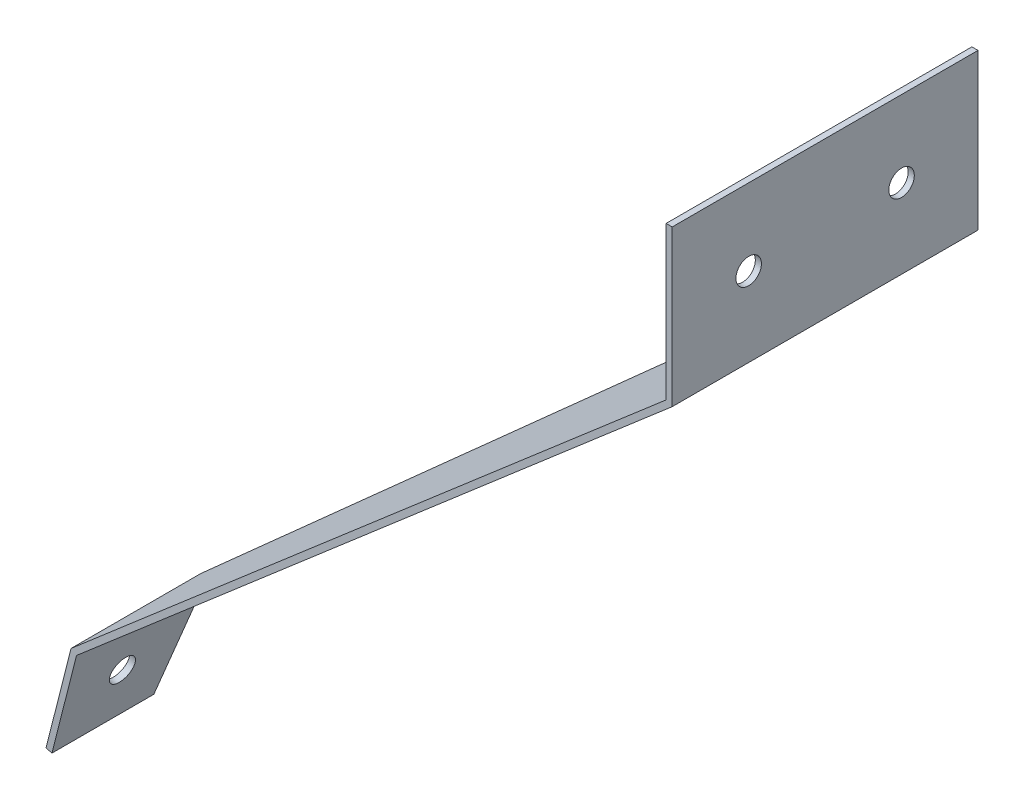
ISO-10303-21;
HEADER;
FILE_DESCRIPTION(('STEP AP214'),'2;1');
FILE_NAME('part.step','',(''),(''),'','','');
FILE_SCHEMA(('AUTOMOTIVE_DESIGN { 1 0 10303 214 1 1 1 1 }'));
ENDSEC;
DATA;
#1=APPLICATION_CONTEXT('core data for automotive mechanical design processes');
#2=APPLICATION_PROTOCOL_DEFINITION('international standard','automotive_design',2000,#1);
#3=PRODUCT_CONTEXT('',#1,'mechanical');
#4=PRODUCT('Part','Part','',(#3));
#5=PRODUCT_RELATED_PRODUCT_CATEGORY('part','',(#4));
#6=PRODUCT_DEFINITION_FORMATION('','',#4);
#7=PRODUCT_DEFINITION_CONTEXT('part definition',#1,'design');
#8=PRODUCT_DEFINITION('design','',#6,#7);
#9=PRODUCT_DEFINITION_SHAPE('','',#8);
#10=(LENGTH_UNIT() NAMED_UNIT(*) SI_UNIT(.MILLI.,.METRE.));
#11=(NAMED_UNIT(*) PLANE_ANGLE_UNIT() SI_UNIT($,.RADIAN.));
#12=(NAMED_UNIT(*) SI_UNIT($,.STERADIAN.) SOLID_ANGLE_UNIT());
#13=UNCERTAINTY_MEASURE_WITH_UNIT(LENGTH_MEASURE(1.E-05),#10,'distance_accuracy_value','');
#14=(GEOMETRIC_REPRESENTATION_CONTEXT(3) GLOBAL_UNCERTAINTY_ASSIGNED_CONTEXT((#13)) GLOBAL_UNIT_ASSIGNED_CONTEXT((#10,
#11,#12)) REPRESENTATION_CONTEXT('',''));
#15=CARTESIAN_POINT('',(0.,0.,0.));
#16=DIRECTION('',(0.,0.,1.));
#17=DIRECTION('',(1.,0.,0.));
#18=AXIS2_PLACEMENT_3D('',#15,#16,#17);
#19=CARTESIAN_POINT('',(0.,0.,76.2));
#20=DIRECTION('',(-1.,0.,0.));
#21=DIRECTION('',(0.,0.,1.));
#22=AXIS2_PLACEMENT_3D('',#19,#20,#21);
#23=PLANE('',#22);
#24=CARTESIAN_POINT('',(0.,19.05,19.05));
#25=DIRECTION('',(-1.,0.,0.));
#26=DIRECTION('',(0.,0.,1.));
#27=AXIS2_PLACEMENT_3D('',#24,#25,#26);
#28=CIRCLE('',#27,3.175);
#29=CARTESIAN_POINT('',(0.,19.05,22.225));
#30=VERTEX_POINT('',#29);
#31=EDGE_CURVE('E231',#30,#30,#28,.T.);
#32=ORIENTED_EDGE('',*,*,#31,.F.);
#33=EDGE_LOOP('',(#32));
#34=FACE_BOUND('',#33,.T.);
#35=CARTESIAN_POINT('',(0.,19.05,57.15));
#36=DIRECTION('',(-1.,0.,0.));
#37=DIRECTION('',(0.,0.,1.));
#38=AXIS2_PLACEMENT_3D('',#35,#36,#37);
#39=CIRCLE('',#38,3.175);
#40=CARTESIAN_POINT('',(0.,19.05,60.325));
#41=VERTEX_POINT('',#40);
#42=EDGE_CURVE('E223',#41,#41,#39,.T.);
#43=ORIENTED_EDGE('',*,*,#42,.F.);
#44=EDGE_LOOP('',(#43));
#45=FACE_BOUND('',#44,.T.);
#46=DIRECTION('',(0.,1.,0.));
#47=VECTOR('',#46,1.);
#48=CARTESIAN_POINT('',(0.,0.,0.));
#49=LINE('',#48,#47);
#50=CARTESIAN_POINT('',(0.,0.,0.));
#51=VERTEX_POINT('',#50);
#52=CARTESIAN_POINT('',(0.,38.1,0.));
#53=VERTEX_POINT('',#52);
#54=EDGE_CURVE('E207',#51,#53,#49,.T.);
#55=ORIENTED_EDGE('',*,*,#54,.F.);
#56=DIRECTION('',(0.,0.,-1.));
#57=VECTOR('',#56,1.);
#58=CARTESIAN_POINT('',(0.,0.,76.2));
#59=LINE('',#58,#57);
#60=CARTESIAN_POINT('',(0.,0.,76.2));
#61=VERTEX_POINT('',#60);
#62=EDGE_CURVE('E56',#61,#51,#59,.T.);
#63=ORIENTED_EDGE('',*,*,#62,.F.);
#64=DIRECTION('',(0.,1.,0.));
#65=VECTOR('',#64,1.);
#66=CARTESIAN_POINT('',(0.,0.,76.2));
#67=LINE('',#66,#65);
#68=CARTESIAN_POINT('',(0.,38.1,76.2));
#69=VERTEX_POINT('',#68);
#70=EDGE_CURVE('E177',#61,#69,#67,.T.);
#71=ORIENTED_EDGE('',*,*,#70,.T.);
#72=DIRECTION('',(0.,0.,-1.));
#73=VECTOR('',#72,1.);
#74=CARTESIAN_POINT('',(0.,38.1,76.2));
#75=LINE('',#74,#73);
#76=EDGE_CURVE('E172',#69,#53,#75,.T.);
#77=ORIENTED_EDGE('',*,*,#76,.T.);
#78=EDGE_LOOP('',(#55,#63,#71,#77));
#79=FACE_BOUND('',#78,.T.);
#80=ADVANCED_FACE('F46',(#34,#45,#79),#23,.T.);
#81=CARTESIAN_POINT('',(0.,0.,76.2));
#82=DIRECTION('',(0.652759752462726,-0.757564984384047,0.));
#83=DIRECTION('',(0.757564984384047,0.652759752462726,0.));
#84=AXIS2_PLACEMENT_3D('',#81,#82,#83);
#85=PLANE('',#84);
#86=ORIENTED_EDGE('',*,*,#62,.T.);
#87=DIRECTION('',(-0.739242312652907,-0.636971928434139,0.218603672362739));
#88=VECTOR('',#87,1.);
#89=CARTESIAN_POINT('',(-12.3140026245629,-10.6104234893731,3.64141249647024));
#90=LINE('',#89,#88);
#91=CARTESIAN_POINT('',(-148.297771302394,-127.781534893448,43.853600984464));
#92=VERTEX_POINT('',#91);
#93=EDGE_CURVE('E87',#51,#92,#90,.T.);
#94=ORIENTED_EDGE('',*,*,#93,.T.);
#95=DIRECTION('',(0.,0.,-1.));
#96=VECTOR('',#95,1.);
#97=CARTESIAN_POINT('',(-148.297771302394,-127.781534893448,76.2));
#98=LINE('',#97,#96);
#99=CARTESIAN_POINT('',(-148.297771302394,-127.781534893448,76.2));
#100=VERTEX_POINT('',#99);
#101=EDGE_CURVE('E133',#100,#92,#98,.T.);
#102=ORIENTED_EDGE('',*,*,#101,.F.);
#103=DIRECTION('',(-0.757564984384047,-0.652759752462726,0.));
#104=VECTOR('',#103,1.);
#105=CARTESIAN_POINT('',(0.,0.,76.2));
#106=LINE('',#105,#104);
#107=EDGE_CURVE('E118',#61,#100,#106,.T.);
#108=ORIENTED_EDGE('',*,*,#107,.F.);
#109=EDGE_LOOP('',(#86,#94,#102,#108));
#110=FACE_BOUND('',#109,.T.);
#111=ADVANCED_FACE('F251',(#110),#85,.F.);
#112=CARTESIAN_POINT('',(-148.297771302394,-127.781534893448,76.2));
#113=DIRECTION('',(0.969230909706754,-0.246153293028993,0.));
#114=DIRECTION('',(0.246153293028993,0.969230909706755,0.));
#115=AXIS2_PLACEMENT_3D('',#112,#113,#114);
#116=PLANE('',#115);
#117=CARTESIAN_POINT('',(-151.423918123863,-140.090767446724,61.763400246116));
#118=DIRECTION('',(-0.969230909706754,0.246153293028993,0.));
#119=DIRECTION('',(-0.246153293028993,-0.969230909706754,0.));
#120=AXIS2_PLACEMENT_3D('',#117,#118,#119);
#121=CIRCLE('',#120,3.17499999999999);
#122=CARTESIAN_POINT('',(-152.20545482923,-143.168075585043,61.763400246116));
#123=VERTEX_POINT('',#122);
#124=EDGE_CURVE('E218',#123,#123,#121,.T.);
#125=ORIENTED_EDGE('',*,*,#124,.F.);
#126=EDGE_LOOP('',(#125));
#127=FACE_BOUND('',#126,.T.);
#128=ORIENTED_EDGE('',*,*,#101,.T.);
#129=DIRECTION('',(0.237434348415611,0.934899983171816,-0.263793388199537));
#130=VECTOR('',#129,1.);
#131=CARTESIAN_POINT('',(-154.550064945331,-152.4,50.8));
#132=LINE('',#131,#130);
#133=CARTESIAN_POINT('',(-154.550064945331,-152.4,50.8));
#134=VERTEX_POINT('',#133);
#135=EDGE_CURVE('E129',#134,#92,#132,.T.);
#136=ORIENTED_EDGE('',*,*,#135,.F.);
#137=DIRECTION('',(0.,0.,-1.));
#138=VECTOR('',#137,1.);
#139=CARTESIAN_POINT('',(-154.550064945331,-152.4,76.2));
#140=LINE('',#139,#138);
#141=CARTESIAN_POINT('',(-154.550064945331,-152.4,76.2));
#142=VERTEX_POINT('',#141);
#143=EDGE_CURVE('E126',#142,#134,#140,.T.);
#144=ORIENTED_EDGE('',*,*,#143,.F.);
#145=DIRECTION('',(-0.246153293028993,-0.969230909706754,0.));
#146=VECTOR('',#145,1.);
#147=CARTESIAN_POINT('',(-148.297771302394,-127.781534893448,76.2));
#148=LINE('',#147,#146);
#149=EDGE_CURVE('E111',#100,#142,#148,.T.);
#150=ORIENTED_EDGE('',*,*,#149,.F.);
#151=EDGE_LOOP('',(#128,#136,#144,#150));
#152=FACE_BOUND('',#151,.T.);
#153=ADVANCED_FACE('F127',(#127,#152),#116,.F.);
#154=CARTESIAN_POINT('',(-154.550064945331,-152.4,76.2));
#155=DIRECTION('',(0.246153293028993,0.969230909706754,0.));
#156=DIRECTION('',(-0.969230909706754,0.246153293028993,0.));
#157=AXIS2_PLACEMENT_3D('',#154,#155,#156);
#158=PLANE('',#157);
#159=ORIENTED_EDGE('',*,*,#143,.T.);
#160=DIRECTION('',(-0.969230909706754,0.246153293028993,0.));
#161=VECTOR('',#160,1.);
#162=CARTESIAN_POINT('',(-7.84325281382625,-189.65878379888,50.8));
#163=LINE('',#162,#161);
#164=CARTESIAN_POINT('',(-153.072957038938,-152.775137618576,50.8));
#165=VERTEX_POINT('',#164);
#166=EDGE_CURVE('E213',#165,#134,#163,.T.);
#167=ORIENTED_EDGE('',*,*,#166,.F.);
#168=DIRECTION('',(0.,0.,-1.));
#169=VECTOR('',#168,1.);
#170=CARTESIAN_POINT('',(-153.072957038938,-152.775137618576,76.2));
#171=LINE('',#170,#169);
#172=CARTESIAN_POINT('',(-153.072957038938,-152.775137618576,76.2));
#173=VERTEX_POINT('',#172);
#174=EDGE_CURVE('E134',#173,#165,#171,.T.);
#175=ORIENTED_EDGE('',*,*,#174,.F.);
#176=DIRECTION('',(0.969230909706755,-0.246153293028993,0.));
#177=VECTOR('',#176,1.);
#178=CARTESIAN_POINT('',(-154.550064945331,-152.4,76.2));
#179=LINE('',#178,#177);
#180=EDGE_CURVE('E116',#142,#173,#179,.T.);
#181=ORIENTED_EDGE('',*,*,#180,.F.);
#182=EDGE_LOOP('',(#159,#167,#175,#181));
#183=FACE_BOUND('',#182,.T.);
#184=ADVANCED_FACE('F135',(#183),#158,.F.);
#185=CARTESIAN_POINT('',(-146.938943832801,-128.622402845954,76.2));
#186=DIRECTION('',(0.969230909706754,-0.246153293028993,0.));
#187=DIRECTION('',(0.246153293028993,0.969230909706755,0.));
#188=AXIS2_PLACEMENT_3D('',#185,#186,#187);
#189=PLANE('',#188);
#190=CARTESIAN_POINT('',(-149.946810217469,-140.4659050653,61.763400246116));
#191=DIRECTION('',(0.969230909706754,-0.246153293028993,0.));
#192=DIRECTION('',(0.246153293028993,0.969230909706755,0.));
#193=AXIS2_PLACEMENT_3D('',#190,#191,#192);
#194=CIRCLE('',#193,3.17499999999999);
#195=CARTESIAN_POINT('',(-149.165273512102,-137.388596926982,61.763400246116));
#196=VERTEX_POINT('',#195);
#197=EDGE_CURVE('E49',#196,#196,#194,.T.);
#198=ORIENTED_EDGE('',*,*,#197,.F.);
#199=EDGE_LOOP('',(#198));
#200=FACE_BOUND('',#199,.T.);
#201=DIRECTION('',(-0.23743434841561,-0.934899983171817,0.263793388199537));
#202=VECTOR('',#201,1.);
#203=CARTESIAN_POINT('',(-148.95668483883,-136.56727706137,46.2267552371265));
#204=LINE('',#203,#202);
#205=CARTESIAN_POINT('',(-146.938943832801,-128.622402845954,43.9850124562641));
#206=VERTEX_POINT('',#205);
#207=EDGE_CURVE('E199',#206,#165,#204,.T.);
#208=ORIENTED_EDGE('',*,*,#207,.F.);
#209=DIRECTION('',(0.,0.,-1.));
#210=VECTOR('',#209,1.);
#211=CARTESIAN_POINT('',(-146.938943832801,-128.622402845954,76.2));
#212=LINE('',#211,#210);
#213=CARTESIAN_POINT('',(-146.938943832801,-128.622402845954,76.2));
#214=VERTEX_POINT('',#213);
#215=EDGE_CURVE('E161',#214,#206,#212,.T.);
#216=ORIENTED_EDGE('',*,*,#215,.F.);
#217=DIRECTION('',(-0.246153293028993,-0.969230909706754,0.));
#218=VECTOR('',#217,1.);
#219=CARTESIAN_POINT('',(-146.938943832801,-128.622402845954,76.2));
#220=LINE('',#219,#218);
#221=EDGE_CURVE('E139',#214,#173,#220,.T.);
#222=ORIENTED_EDGE('',*,*,#221,.T.);
#223=ORIENTED_EDGE('',*,*,#174,.T.);
#224=EDGE_LOOP('',(#208,#216,#222,#223));
#225=FACE_BOUND('',#224,.T.);
#226=ADVANCED_FACE('F196',(#200,#225),#189,.T.);
#227=CARTESIAN_POINT('',(1.524,-0.698546194920925,76.2));
#228=DIRECTION('',(0.652759752462726,-0.757564984384047,0.));
#229=DIRECTION('',(0.757564984384047,0.652759752462726,0.));
#230=AXIS2_PLACEMENT_3D('',#227,#228,#229);
#231=PLANE('',#230);
#232=DIRECTION('',(-0.739242312652907,-0.636971928434139,0.218603672362739));
#233=VECTOR('',#232,1.);
#234=CARTESIAN_POINT('',(-10.7766595813563,-11.2974725827117,3.72003456579985));
#235=LINE('',#234,#233);
#236=CARTESIAN_POINT('',(1.524,-0.698546194920924,0.0825677826573525));
#237=VERTEX_POINT('',#236);
#238=EDGE_CURVE('E204',#237,#206,#235,.T.);
#239=ORIENTED_EDGE('',*,*,#238,.F.);
#240=DIRECTION('',(0.,0.,-1.));
#241=VECTOR('',#240,1.);
#242=CARTESIAN_POINT('',(1.524,-0.698546194920925,76.2));
#243=LINE('',#242,#241);
#244=CARTESIAN_POINT('',(1.524,-0.698546194920925,76.2));
#245=VERTEX_POINT('',#244);
#246=EDGE_CURVE('E165',#245,#237,#243,.T.);
#247=ORIENTED_EDGE('',*,*,#246,.F.);
#248=DIRECTION('',(-0.757564984384047,-0.652759752462726,0.));
#249=VECTOR('',#248,1.);
#250=CARTESIAN_POINT('',(1.524,-0.698546194920925,76.2));
#251=LINE('',#250,#249);
#252=EDGE_CURVE('E142',#245,#214,#251,.T.);
#253=ORIENTED_EDGE('',*,*,#252,.T.);
#254=ORIENTED_EDGE('',*,*,#215,.T.);
#255=EDGE_LOOP('',(#239,#247,#253,#254));
#256=FACE_BOUND('',#255,.T.);
#257=ADVANCED_FACE('F192',(#256),#231,.T.);
#258=CARTESIAN_POINT('',(1.524,-0.698546194920925,76.2));
#259=DIRECTION('',(-1.,0.,0.));
#260=DIRECTION('',(0.,0.,1.));
#261=AXIS2_PLACEMENT_3D('',#258,#259,#260);
#262=PLANE('',#261);
#263=CARTESIAN_POINT('',(1.524,19.05,19.05));
#264=DIRECTION('',(-1.,0.,0.));
#265=DIRECTION('',(0.,0.,1.));
#266=AXIS2_PLACEMENT_3D('',#263,#264,#265);
#267=CIRCLE('',#266,3.175);
#268=CARTESIAN_POINT('',(1.524,19.05,22.225));
#269=VERTEX_POINT('',#268);
#270=EDGE_CURVE('E222',#269,#269,#267,.T.);
#271=ORIENTED_EDGE('',*,*,#270,.T.);
#272=EDGE_LOOP('',(#271));
#273=FACE_BOUND('',#272,.T.);
#274=CARTESIAN_POINT('',(1.524,19.05,57.15));
#275=DIRECTION('',(-1.,0.,0.));
#276=DIRECTION('',(0.,0.,1.));
#277=AXIS2_PLACEMENT_3D('',#274,#275,#276);
#278=CIRCLE('',#277,3.175);
#279=CARTESIAN_POINT('',(1.524,19.05,60.325));
#280=VERTEX_POINT('',#279);
#281=EDGE_CURVE('E227',#280,#280,#278,.T.);
#282=ORIENTED_EDGE('',*,*,#281,.T.);
#283=EDGE_LOOP('',(#282));
#284=FACE_BOUND('',#283,.T.);
#285=ORIENTED_EDGE('',*,*,#246,.T.);
#286=DIRECTION('',(0.,0.966619174412419,-0.256217430434102));
#287=VECTOR('',#286,1.);
#288=CARTESIAN_POINT('',(1.524,-19.5501457693747,5.07947714510121));
#289=LINE('',#288,#287);
#290=CARTESIAN_POINT('',(1.52399999999998,-0.387046693227859,0.));
#291=VERTEX_POINT('',#290);
#292=EDGE_CURVE('E208',#237,#291,#289,.T.);
#293=ORIENTED_EDGE('',*,*,#292,.T.);
#294=DIRECTION('',(0.,1.,0.));
#295=VECTOR('',#294,1.);
#296=CARTESIAN_POINT('',(1.524,-0.698546194920925,0.));
#297=LINE('',#296,#295);
#298=CARTESIAN_POINT('',(1.524,38.1,0.));
#299=VERTEX_POINT('',#298);
#300=EDGE_CURVE('E79',#291,#299,#297,.T.);
#301=ORIENTED_EDGE('',*,*,#300,.T.);
#302=DIRECTION('',(0.,0.,-1.));
#303=VECTOR('',#302,1.);
#304=CARTESIAN_POINT('',(1.524,38.1,76.2));
#305=LINE('',#304,#303);
#306=CARTESIAN_POINT('',(1.524,38.1,76.2));
#307=VERTEX_POINT('',#306);
#308=EDGE_CURVE('E168',#307,#299,#305,.T.);
#309=ORIENTED_EDGE('',*,*,#308,.F.);
#310=DIRECTION('',(0.,1.,0.));
#311=VECTOR('',#310,1.);
#312=CARTESIAN_POINT('',(1.524,-0.698546194920925,76.2));
#313=LINE('',#312,#311);
#314=EDGE_CURVE('E185',#245,#307,#313,.T.);
#315=ORIENTED_EDGE('',*,*,#314,.F.);
#316=EDGE_LOOP('',(#285,#293,#301,#309,#315));
#317=FACE_BOUND('',#316,.T.);
#318=ADVANCED_FACE('F239',(#273,#284,#317),#262,.F.);
#319=CARTESIAN_POINT('',(1.524,38.1,76.2));
#320=DIRECTION('',(0.,-1.,0.));
#321=DIRECTION('',(0.,0.,-1.));
#322=AXIS2_PLACEMENT_3D('',#319,#320,#321);
#323=PLANE('',#322);
#324=DIRECTION('',(-1.,0.,0.));
#325=VECTOR('',#324,1.);
#326=CARTESIAN_POINT('',(1.524,38.1,0.));
#327=LINE('',#326,#325);
#328=EDGE_CURVE('E258',#299,#53,#327,.T.);
#329=ORIENTED_EDGE('',*,*,#328,.T.);
#330=ORIENTED_EDGE('',*,*,#76,.F.);
#331=DIRECTION('',(-1.,0.,0.));
#332=VECTOR('',#331,1.);
#333=CARTESIAN_POINT('',(1.524,38.1,76.2));
#334=LINE('',#333,#332);
#335=EDGE_CURVE('E95',#307,#69,#334,.T.);
#336=ORIENTED_EDGE('',*,*,#335,.F.);
#337=ORIENTED_EDGE('',*,*,#308,.T.);
#338=EDGE_LOOP('',(#329,#330,#336,#337));
#339=FACE_BOUND('',#338,.T.);
#340=ADVANCED_FACE('F263',(#339),#323,.F.);
#341=CARTESIAN_POINT('',(0.,0.,76.2));
#342=DIRECTION('',(0.,0.,1.));
#343=DIRECTION('',(1.,0.,0.));
#344=AXIS2_PLACEMENT_3D('',#341,#342,#343);
#345=PLANE('',#344);
#346=ORIENTED_EDGE('',*,*,#70,.F.);
#347=ORIENTED_EDGE('',*,*,#107,.T.);
#348=ORIENTED_EDGE('',*,*,#149,.T.);
#349=ORIENTED_EDGE('',*,*,#180,.T.);
#350=ORIENTED_EDGE('',*,*,#221,.F.);
#351=ORIENTED_EDGE('',*,*,#252,.F.);
#352=ORIENTED_EDGE('',*,*,#314,.T.);
#353=ORIENTED_EDGE('',*,*,#335,.T.);
#354=EDGE_LOOP('',(#346,#347,#348,#349,#350,#351,#352,#353));
#355=FACE_BOUND('',#354,.T.);
#356=ADVANCED_FACE('F113',(#355),#345,.T.);
#357=CARTESIAN_POINT('',(0.,0.,0.));
#358=DIRECTION('',(0.,0.,1.));
#359=DIRECTION('',(1.,0.,0.));
#360=AXIS2_PLACEMENT_3D('',#357,#358,#359);
#361=PLANE('',#360);
#362=ORIENTED_EDGE('',*,*,#300,.F.);
#363=DIRECTION('',(-0.969230909706754,0.246153293028993,0.));
#364=VECTOR('',#363,1.);
#365=CARTESIAN_POINT('',(0.,0.,0.));
#366=LINE('',#365,#364);
#367=EDGE_CURVE('E12',#291,#51,#366,.T.);
#368=ORIENTED_EDGE('',*,*,#367,.T.);
#369=ORIENTED_EDGE('',*,*,#54,.T.);
#370=ORIENTED_EDGE('',*,*,#328,.F.);
#371=EDGE_LOOP('',(#362,#368,#369,#370));
#372=FACE_BOUND('',#371,.T.);
#373=ADVANCED_FACE('F264',(#372),#361,.F.);
#374=CARTESIAN_POINT('',(-7.84325281382625,-189.65878379888,50.8));
#375=DIRECTION('',(0.0649336111845916,0.255676705619264,0.964579207915145));
#376=DIRECTION('',(0.,-0.966619174412419,0.256217430434102));
#377=AXIS2_PLACEMENT_3D('',#374,#375,#376);
#378=PLANE('',#377);
#379=ORIENTED_EDGE('',*,*,#367,.F.);
#380=ORIENTED_EDGE('',*,*,#292,.F.);
#381=ORIENTED_EDGE('',*,*,#238,.T.);
#382=ORIENTED_EDGE('',*,*,#207,.T.);
#383=ORIENTED_EDGE('',*,*,#166,.T.);
#384=ORIENTED_EDGE('',*,*,#135,.T.);
#385=ORIENTED_EDGE('',*,*,#93,.F.);
#386=EDGE_LOOP('',(#379,#380,#381,#382,#383,#384,#385));
#387=FACE_BOUND('',#386,.T.);
#388=ADVANCED_FACE('F272',(#387),#378,.F.);
#389=CARTESIAN_POINT('',(-4.71710599235806,-177.349551245604,61.763400246116));
#390=DIRECTION('',(-0.969230909706754,0.246153293028993,0.));
#391=DIRECTION('',(-0.246153293028993,-0.969230909706754,0.));
#392=AXIS2_PLACEMENT_3D('',#389,#390,#391);
#393=CYLINDRICAL_SURFACE('',#392,3.17499999999999);
#394=ORIENTED_EDGE('',*,*,#197,.T.);
#395=EDGE_LOOP('',(#394));
#396=FACE_BOUND('',#395,.T.);
#397=ORIENTED_EDGE('',*,*,#124,.T.);
#398=EDGE_LOOP('',(#397));
#399=FACE_BOUND('',#398,.T.);
#400=ADVANCED_FACE('F304',(#396,#399),#393,.F.);
#401=CARTESIAN_POINT('',(1.524,19.05,57.15));
#402=DIRECTION('',(-1.,0.,0.));
#403=DIRECTION('',(0.,0.,1.));
#404=AXIS2_PLACEMENT_3D('',#401,#402,#403);
#405=CYLINDRICAL_SURFACE('',#404,3.175);
#406=ORIENTED_EDGE('',*,*,#281,.F.);
#407=EDGE_LOOP('',(#406));
#408=FACE_BOUND('',#407,.T.);
#409=ORIENTED_EDGE('',*,*,#42,.T.);
#410=EDGE_LOOP('',(#409));
#411=FACE_BOUND('',#410,.T.);
#412=ADVANCED_FACE('F245',(#408,#411),#405,.F.);
#413=CARTESIAN_POINT('',(1.524,19.05,19.05));
#414=DIRECTION('',(-1.,0.,0.));
#415=DIRECTION('',(0.,0.,1.));
#416=AXIS2_PLACEMENT_3D('',#413,#414,#415);
#417=CYLINDRICAL_SURFACE('',#416,3.175);
#418=ORIENTED_EDGE('',*,*,#270,.F.);
#419=EDGE_LOOP('',(#418));
#420=FACE_BOUND('',#419,.T.);
#421=ORIENTED_EDGE('',*,*,#31,.T.);
#422=EDGE_LOOP('',(#421));
#423=FACE_BOUND('',#422,.T.);
#424=ADVANCED_FACE('F242',(#420,#423),#417,.F.);
#425=CLOSED_SHELL('',(#80,#111,#153,#184,#226,#257,#318,#340,#356,#373,#388,#400,#412,#424));
#426=MANIFOLD_SOLID_BREP('B2',#425);
#427=ADVANCED_BREP_SHAPE_REPRESENTATION('',(#18,#426),#14);
#428=SHAPE_DEFINITION_REPRESENTATION(#9,#427);
ENDSEC;
END-ISO-10303-21;
